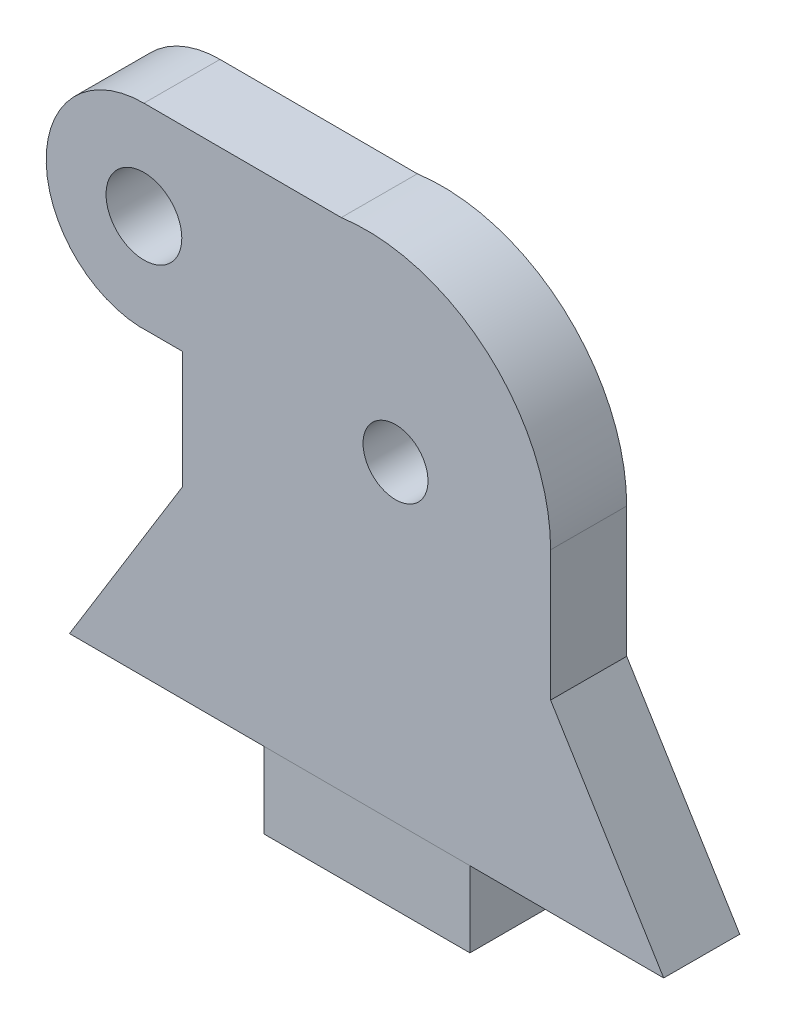
ISO-10303-21;
HEADER;
FILE_DESCRIPTION(('STEP AP214'),'2;1');
FILE_NAME('part.step','',(''),(''),'','','');
FILE_SCHEMA(('AUTOMOTIVE_DESIGN { 1 0 10303 214 1 1 1 1 }'));
ENDSEC;
DATA;
#1=APPLICATION_CONTEXT('core data for automotive mechanical design processes');
#2=APPLICATION_PROTOCOL_DEFINITION('international standard','automotive_design',2000,#1);
#3=PRODUCT_CONTEXT('',#1,'mechanical');
#4=PRODUCT('Part','Part','',(#3));
#5=PRODUCT_RELATED_PRODUCT_CATEGORY('part','',(#4));
#6=PRODUCT_DEFINITION_FORMATION('','',#4);
#7=PRODUCT_DEFINITION_CONTEXT('part definition',#1,'design');
#8=PRODUCT_DEFINITION('design','',#6,#7);
#9=PRODUCT_DEFINITION_SHAPE('','',#8);
#10=(LENGTH_UNIT() NAMED_UNIT(*) SI_UNIT(.MILLI.,.METRE.));
#11=(NAMED_UNIT(*) PLANE_ANGLE_UNIT() SI_UNIT($,.RADIAN.));
#12=(NAMED_UNIT(*) SI_UNIT($,.STERADIAN.) SOLID_ANGLE_UNIT());
#13=UNCERTAINTY_MEASURE_WITH_UNIT(LENGTH_MEASURE(1.E-05),#10,'distance_accuracy_value','');
#14=(GEOMETRIC_REPRESENTATION_CONTEXT(3) GLOBAL_UNCERTAINTY_ASSIGNED_CONTEXT((#13)) GLOBAL_UNIT_ASSIGNED_CONTEXT((#10,
#11,#12)) REPRESENTATION_CONTEXT('',''));
#15=CARTESIAN_POINT('',(0.,0.,0.));
#16=DIRECTION('',(0.,0.,1.));
#17=DIRECTION('',(1.,0.,0.));
#18=AXIS2_PLACEMENT_3D('',#15,#16,#17);
#19=CARTESIAN_POINT('',(71.415792523074,8.,61.2864109372668));
#20=DIRECTION('',(0.,1.,0.));
#21=DIRECTION('',(0.707106781186549,0.,0.707106781186546));
#22=AXIS2_PLACEMENT_3D('',#19,#20,#21);
#23=PLANE('',#22);
#24=DIRECTION('',(0.,0.,-1.));
#25=VECTOR('',#24,1.);
#26=CARTESIAN_POINT('',(10.8467152230062,8.,-24.5516889802997));
#27=LINE('',#26,#25);
#28=CARTESIAN_POINT('',(10.8467152227974,8.,-24.5516889802999));
#29=VERTEX_POINT('',#28);
#30=CARTESIAN_POINT('',(10.8467152230062,8.,-31.5144103550522));
#31=VERTEX_POINT('',#30);
#32=EDGE_CURVE('E155',#29,#31,#27,.T.);
#33=ORIENTED_EDGE('',*,*,#32,.F.);
#34=DIRECTION('',(0.999998073826402,0.,0.00196273877145065));
#35=VECTOR('',#34,1.);
#36=CARTESIAN_POINT('',(25.5255760238008,8.,-24.5228781555906));
#37=LINE('',#36,#35);
#38=CARTESIAN_POINT('',(-7.10845551512761,8.,-24.5869303579365));
#39=VERTEX_POINT('',#38);
#40=EDGE_CURVE('E165',#39,#29,#37,.T.);
#41=ORIENTED_EDGE('',*,*,#40,.F.);
#42=DIRECTION('',(-0.00196273877145081,0.,0.999998073826402));
#43=VECTOR('',#42,1.);
#44=CARTESIAN_POINT('',(-7.09471634372746,8.,-31.5869168747213));
#45=LINE('',#44,#43);
#46=CARTESIAN_POINT('',(-7.09471634372746,8.,-31.5869168747213));
#47=VERTEX_POINT('',#46);
#48=EDGE_CURVE('E169',#47,#39,#45,.T.);
#49=ORIENTED_EDGE('',*,*,#48,.F.);
#50=DIRECTION('',(0.999998073826402,0.,0.00196273877145065));
#51=VECTOR('',#50,1.);
#52=CARTESIAN_POINT('',(25.5393151952009,8.,-31.5228646723754));
#53=LINE('',#52,#51);
#54=CARTESIAN_POINT('',(29.8467152230062,8.,-31.5144103550522));
#55=VERTEX_POINT('',#54);
#56=EDGE_CURVE('E12',#47,#55,#53,.T.);
#57=ORIENTED_EDGE('',*,*,#56,.T.);
#58=DIRECTION('',(1.,0.,0.));
#59=VECTOR('',#58,1.);
#60=CARTESIAN_POINT('',(10.8467152230062,8.,-31.5144103550522));
#61=LINE('',#60,#59);
#62=EDGE_CURVE('E60',#31,#55,#61,.T.);
#63=ORIENTED_EDGE('',*,*,#62,.F.);
#64=EDGE_LOOP('',(#33,#41,#49,#57,#63));
#65=FACE_BOUND('',#64,.T.);
#66=ADVANCED_FACE('F36',(#65),#23,.F.);
#67=DIRECTION('',(-1.,0.,0.));
#68=VECTOR('',#67,1.);
#69=CARTESIAN_POINT('',(10.8467152230062,8.,-24.5516889802997));
#70=LINE('',#69,#68);
#71=CARTESIAN_POINT('',(29.8467152230062,8.,-24.5516889802997));
#72=VERTEX_POINT('',#71);
#73=EDGE_CURVE('E53',#72,#29,#70,.T.);
#74=ORIENTED_EDGE('',*,*,#73,.F.);
#75=DIRECTION('',(0.,0.,1.));
#76=VECTOR('',#75,1.);
#77=CARTESIAN_POINT('',(29.8467152230062,8.,-24.5516889802997));
#78=LINE('',#77,#76);
#79=EDGE_CURVE('E282',#55,#72,#78,.T.);
#80=ORIENTED_EDGE('',*,*,#79,.F.);
#81=CARTESIAN_POINT('',(47.7935848087063,8.,-31.4791852704406));
#82=VERTEX_POINT('',#81);
#83=EDGE_CURVE('E45',#55,#82,#53,.T.);
#84=ORIENTED_EDGE('',*,*,#83,.T.);
#85=DIRECTION('',(0.00196273877145081,0.,-0.999998073826402));
#86=VECTOR('',#85,1.);
#87=CARTESIAN_POINT('',(47.7935848087063,8.,-31.4791852704406));
#88=LINE('',#87,#86);
#89=CARTESIAN_POINT('',(47.7798456373062,8.,-24.4791987536558));
#90=VERTEX_POINT('',#89);
#91=EDGE_CURVE('E170',#90,#82,#88,.T.);
#92=ORIENTED_EDGE('',*,*,#91,.F.);
#93=EDGE_CURVE('E168',#29,#90,#37,.T.);
#94=ORIENTED_EDGE('',*,*,#93,.F.);
#95=EDGE_LOOP('',(#74,#80,#84,#92,#94));
#96=FACE_BOUND('',#95,.T.);
#97=ADVANCED_FACE('F254',(#96),#23,.F.);
#98=CARTESIAN_POINT('',(23.0082300446321,36.7773767864272,-24.5278190576621));
#99=DIRECTION('',(0.00196273877145081,0.,-0.999998073826403));
#100=DIRECTION('',(-0.999998073826403,0.,-0.00196273877145081));
#101=AXIS2_PLACEMENT_3D('',#98,#99,#100);
#102=CYLINDRICAL_SURFACE('',#101,3.);
#103=CARTESIAN_POINT('',(23.0082300446321,36.7773767864272,-24.5278190576621));
#104=DIRECTION('',(0.0019627387714507,0.,-0.999998073826402));
#105=DIRECTION('',(-0.999998073826402,0.,-0.0019627387714507));
#106=AXIS2_PLACEMENT_3D('',#103,#104,#105);
#107=CIRCLE('',#106,3.);
#108=CARTESIAN_POINT('',(20.0082358231529,36.7773767864272,-24.5337072739765));
#109=VERTEX_POINT('',#108);
#110=EDGE_CURVE('E175',#109,#109,#107,.T.);
#111=ORIENTED_EDGE('',*,*,#110,.F.);
#112=EDGE_LOOP('',(#111));
#113=FACE_BOUND('',#112,.T.);
#114=CARTESIAN_POINT('',(23.0219692160323,36.7773767864272,-31.5278055744469));
#115=DIRECTION('',(0.0019627387714507,0.,-0.999998073826402));
#116=DIRECTION('',(-0.999998073826402,0.,-0.0019627387714507));
#117=AXIS2_PLACEMENT_3D('',#114,#115,#116);
#118=CIRCLE('',#117,3.);
#119=CARTESIAN_POINT('',(20.0219749945531,36.7773767864272,-31.5336937907613));
#120=VERTEX_POINT('',#119);
#121=EDGE_CURVE('E179',#120,#120,#118,.T.);
#122=ORIENTED_EDGE('',*,*,#121,.T.);
#123=EDGE_LOOP('',(#122));
#124=FACE_BOUND('',#123,.T.);
#125=ADVANCED_FACE('F310',(#113,#124),#102,.F.);
#126=CARTESIAN_POINT('',(-0.21913046735704,44.7671616125226,-31.5734218697516));
#127=DIRECTION('',(-0.00196273877145048,0.,0.999998073826403));
#128=DIRECTION('',(0.999998073826402,0.,0.00196273877145042));
#129=AXIS2_PLACEMENT_3D('',#126,#127,#128);
#130=CYLINDRICAL_SURFACE('',#129,3.5);
#131=CARTESIAN_POINT('',(-0.21913046735704,44.7671616125226,-31.5734218697516));
#132=DIRECTION('',(-0.00196273877145042,0.,0.999998073826402));
#133=DIRECTION('',(0.999998073826402,0.,0.00196273877145042));
#134=AXIS2_PLACEMENT_3D('',#131,#132,#133);
#135=CIRCLE('',#134,3.5);
#136=CARTESIAN_POINT('',(3.28086279103537,44.7671616125226,-31.5665522840515));
#137=VERTEX_POINT('',#136);
#138=EDGE_CURVE('E159',#137,#137,#135,.T.);
#139=ORIENTED_EDGE('',*,*,#138,.F.);
#140=EDGE_LOOP('',(#139));
#141=FACE_BOUND('',#140,.T.);
#142=CARTESIAN_POINT('',(-0.232869638757193,44.7671616125226,-24.5734353529668));
#143=DIRECTION('',(-0.00196273877145042,0.,0.999998073826402));
#144=DIRECTION('',(0.999998073826402,0.,0.00196273877145042));
#145=AXIS2_PLACEMENT_3D('',#142,#143,#144);
#146=CIRCLE('',#145,3.5);
#147=CARTESIAN_POINT('',(3.26712361963521,44.7671616125226,-24.5665657672667));
#148=VERTEX_POINT('',#147);
#149=EDGE_CURVE('E156',#148,#148,#146,.T.);
#150=ORIENTED_EDGE('',*,*,#149,.T.);
#151=EDGE_LOOP('',(#150));
#152=FACE_BOUND('',#151,.T.);
#153=ADVANCED_FACE('F315',(#141,#152),#130,.F.);
#154=CARTESIAN_POINT('',(20.3494342324894,36.9567860572509,-31.5330510725809));
#155=DIRECTION('',(-0.00196273877145081,0.,0.999998073826403));
#156=DIRECTION('',(0.999998073826403,0.,0.00196273877145081));
#157=AXIS2_PLACEMENT_3D('',#154,#155,#156);
#158=CYLINDRICAL_SURFACE('',#157,17.);
#159=DIRECTION('',(-0.00196273877145081,0.,0.999998073826403));
#160=VECTOR('',#159,1.);
#161=CARTESIAN_POINT('',(18.0120803058191,53.7953357446553,-31.537638696592));
#162=LINE('',#161,#160);
#163=CARTESIAN_POINT('',(18.0120803058191,53.7953357446553,-31.537638696592));
#164=VERTEX_POINT('',#163);
#165=CARTESIAN_POINT('',(17.9983411344189,53.7953357446553,-24.5376521798072));
#166=VERTEX_POINT('',#165);
#167=EDGE_CURVE('E228',#164,#166,#162,.T.);
#168=ORIENTED_EDGE('',*,*,#167,.T.);
#169=CARTESIAN_POINT('',(20.3356950610893,36.9567860572509,-24.5330645557961));
#170=DIRECTION('',(0.0019627387714507,0.,-0.999998073826402));
#171=DIRECTION('',(-0.999998073826402,0.,-0.0019627387714507));
#172=AXIS2_PLACEMENT_3D('',#169,#170,#171);
#173=CIRCLE('',#172,17.);
#174=CARTESIAN_POINT('',(37.3356623161381,36.9567860572509,-24.4996979966815));
#175=VERTEX_POINT('',#174);
#176=EDGE_CURVE('E188',#166,#175,#173,.T.);
#177=ORIENTED_EDGE('',*,*,#176,.T.);
#178=DIRECTION('',(-0.00196273877145081,0.,0.999998073826403));
#179=VECTOR('',#178,1.);
#180=CARTESIAN_POINT('',(37.3494014875383,36.9567860572509,-31.4996845134663));
#181=LINE('',#180,#179);
#182=CARTESIAN_POINT('',(37.3494014875383,36.9567860572509,-31.4996845134663));
#183=VERTEX_POINT('',#182);
#184=EDGE_CURVE('E197',#183,#175,#181,.T.);
#185=ORIENTED_EDGE('',*,*,#184,.F.);
#186=CARTESIAN_POINT('',(20.3494342324894,36.9567860572509,-31.5330510725809));
#187=DIRECTION('',(0.0019627387714507,0.,-0.999998073826402));
#188=DIRECTION('',(-0.999998073826402,0.,-0.0019627387714507));
#189=AXIS2_PLACEMENT_3D('',#186,#187,#188);
#190=CIRCLE('',#189,17.);
#191=EDGE_CURVE('E211',#164,#183,#190,.T.);
#192=ORIENTED_EDGE('',*,*,#191,.F.);
#193=EDGE_LOOP('',(#168,#177,#185,#192));
#194=FACE_BOUND('',#193,.T.);
#195=ADVANCED_FACE('F264',(#194),#158,.T.);
#196=CARTESIAN_POINT('',(25.5393151952009,53.7953357446553,-31.5228646723754));
#197=DIRECTION('',(0.,1.,0.));
#198=DIRECTION('',(0.707106781186549,0.,0.707106781186546));
#199=AXIS2_PLACEMENT_3D('',#196,#197,#198);
#200=PLANE('',#199);
#201=DIRECTION('',(-0.999998073826402,0.,-0.00196273877145065));
#202=VECTOR('',#201,1.);
#203=CARTESIAN_POINT('',(25.5255760238008,53.7953357446553,-24.5228781555906));
#204=LINE('',#203,#202);
#205=CARTESIAN_POINT('',(-0.232869638757165,53.7953357446553,-24.5734353529668));
#206=VERTEX_POINT('',#205);
#207=EDGE_CURVE('E190',#166,#206,#204,.T.);
#208=ORIENTED_EDGE('',*,*,#207,.F.);
#209=ORIENTED_EDGE('',*,*,#167,.F.);
#210=DIRECTION('',(-0.999998073826402,0.,-0.00196273877145065));
#211=VECTOR('',#210,1.);
#212=CARTESIAN_POINT('',(25.5393151952009,53.7953357446553,-31.5228646723754));
#213=LINE('',#212,#211);
#214=CARTESIAN_POINT('',(-0.219130467357012,53.7953357446553,-31.5734218697516));
#215=VERTEX_POINT('',#214);
#216=EDGE_CURVE('E216',#164,#215,#213,.T.);
#217=ORIENTED_EDGE('',*,*,#216,.T.);
#218=DIRECTION('',(-0.00196273877145081,0.,0.999998073826403));
#219=VECTOR('',#218,1.);
#220=CARTESIAN_POINT('',(-0.219130467357012,53.7953357446553,-31.5734218697516));
#221=LINE('',#220,#219);
#222=EDGE_CURVE('E171',#215,#206,#221,.T.);
#223=ORIENTED_EDGE('',*,*,#222,.T.);
#224=EDGE_LOOP('',(#208,#209,#217,#223));
#225=FACE_BOUND('',#224,.T.);
#226=ADVANCED_FACE('F267',(#225),#200,.T.);
#227=CARTESIAN_POINT('',(-0.219130467357012,44.7671616125226,-31.5734218697516));
#228=DIRECTION('',(-0.00196273877145081,0.,0.999998073826403));
#229=DIRECTION('',(0.999998073826403,0.,0.00196273877145081));
#230=AXIS2_PLACEMENT_3D('',#227,#228,#229);
#231=CYLINDRICAL_SURFACE('',#230,9.02817413213266);
#232=CARTESIAN_POINT('',(-0.232869638757165,44.7671616125226,-24.5734353529668));
#233=DIRECTION('',(0.00196273877145065,0.,-0.999998073826402));
#234=DIRECTION('',(-0.999998073826402,0.,-0.00196273877145065));
#235=AXIS2_PLACEMENT_3D('',#232,#233,#234);
#236=CIRCLE('',#235,9.02817413213266);
#237=CARTESIAN_POINT('',(0.373410198765602,35.7593676815597,-24.5722453817312));
#238=VERTEX_POINT('',#237);
#239=EDGE_CURVE('E194',#206,#238,#236,.F.);
#240=ORIENTED_EDGE('',*,*,#239,.F.);
#241=ORIENTED_EDGE('',*,*,#222,.F.);
#242=CARTESIAN_POINT('',(-0.219130467357012,44.7671616125226,-31.5734218697516));
#243=DIRECTION('',(0.00196273877145065,0.,-0.999998073826402));
#244=DIRECTION('',(-0.999998073826402,0.,-0.00196273877145065));
#245=AXIS2_PLACEMENT_3D('',#242,#243,#244);
#246=CIRCLE('',#245,9.02817413213266);
#247=CARTESIAN_POINT('',(0.387149370165756,35.7593676815597,-31.572231898516));
#248=VERTEX_POINT('',#247);
#249=EDGE_CURVE('E200',#215,#248,#246,.F.);
#250=ORIENTED_EDGE('',*,*,#249,.T.);
#251=DIRECTION('',(-0.00196273877145081,0.,0.999998073826403));
#252=VECTOR('',#251,1.);
#253=CARTESIAN_POINT('',(0.387149370165756,35.7593676815597,-31.572231898516));
#254=LINE('',#253,#252);
#255=EDGE_CURVE('E215',#248,#238,#254,.T.);
#256=ORIENTED_EDGE('',*,*,#255,.T.);
#257=EDGE_LOOP('',(#240,#241,#250,#256));
#258=FACE_BOUND('',#257,.T.);
#259=ADVANCED_FACE('F271',(#258),#231,.T.);
#260=CARTESIAN_POINT('',(25.5393151952009,35.7593676815597,-31.5228646723754));
#261=DIRECTION('',(0.,-1.,0.));
#262=DIRECTION('',(-0.707106781186549,0.,-0.707106781186546));
#263=AXIS2_PLACEMENT_3D('',#260,#261,#262);
#264=PLANE('',#263);
#265=DIRECTION('',(0.999998073826402,0.,0.00196273877145065));
#266=VECTOR('',#265,1.);
#267=CARTESIAN_POINT('',(25.5255760238008,35.7593676815597,-24.5228781555906));
#268=LINE('',#267,#266);
#269=CARTESIAN_POINT('',(3.33572780604044,35.7593676815597,-24.5664311149108));
#270=VERTEX_POINT('',#269);
#271=EDGE_CURVE('E193',#238,#270,#268,.T.);
#272=ORIENTED_EDGE('',*,*,#271,.F.);
#273=ORIENTED_EDGE('',*,*,#255,.F.);
#274=DIRECTION('',(0.999998073826402,0.,0.00196273877145065));
#275=VECTOR('',#274,1.);
#276=CARTESIAN_POINT('',(25.5393151952009,35.7593676815597,-31.5228646723754));
#277=LINE('',#276,#275);
#278=CARTESIAN_POINT('',(3.3494669774406,35.7593676815597,-31.5664176316956));
#279=VERTEX_POINT('',#278);
#280=EDGE_CURVE('E212',#248,#279,#277,.T.);
#281=ORIENTED_EDGE('',*,*,#280,.T.);
#282=DIRECTION('',(-0.00196273877145081,0.,0.999998073826403));
#283=VECTOR('',#282,1.);
#284=CARTESIAN_POINT('',(3.3494669774406,35.7593676815597,-31.5664176316956));
#285=LINE('',#284,#283);
#286=EDGE_CURVE('E230',#279,#270,#285,.T.);
#287=ORIENTED_EDGE('',*,*,#286,.T.);
#288=EDGE_LOOP('',(#272,#273,#281,#287));
#289=FACE_BOUND('',#288,.T.);
#290=ADVANCED_FACE('F274',(#289),#264,.T.);
#291=CARTESIAN_POINT('',(37.3494014875383,36.9567860572509,-31.4996845134663));
#292=DIRECTION('',(-0.999998073826403,0.,-0.00196273877145081));
#293=DIRECTION('',(-0.00196273877145081,0.,0.999998073826403));
#294=AXIS2_PLACEMENT_3D('',#291,#292,#293);
#295=PLANE('',#294);
#296=DIRECTION('',(0.,-1.,0.));
#297=VECTOR('',#296,1.);
#298=CARTESIAN_POINT('',(37.3356623161381,36.9567860572509,-24.4996979966815));
#299=LINE('',#298,#297);
#300=CARTESIAN_POINT('',(37.3356623161381,24.9567860572509,-24.4996979966815));
#301=VERTEX_POINT('',#300);
#302=EDGE_CURVE('E186',#175,#301,#299,.T.);
#303=ORIENTED_EDGE('',*,*,#302,.T.);
#304=DIRECTION('',(-0.00196273877145081,0.,0.999998073826403));
#305=VECTOR('',#304,1.);
#306=CARTESIAN_POINT('',(37.3494014875383,24.9567860572509,-31.4996845134663));
#307=LINE('',#306,#305);
#308=CARTESIAN_POINT('',(37.3494014875383,24.9567860572509,-31.4996845134663));
#309=VERTEX_POINT('',#308);
#310=EDGE_CURVE('E40',#309,#301,#307,.T.);
#311=ORIENTED_EDGE('',*,*,#310,.F.);
#312=DIRECTION('',(0.,-1.,0.));
#313=VECTOR('',#312,1.);
#314=CARTESIAN_POINT('',(37.3494014875383,36.9567860572509,-31.4996845134663));
#315=LINE('',#314,#313);
#316=EDGE_CURVE('E222',#183,#309,#315,.T.);
#317=ORIENTED_EDGE('',*,*,#316,.F.);
#318=ORIENTED_EDGE('',*,*,#184,.T.);
#319=EDGE_LOOP('',(#303,#311,#317,#318));
#320=FACE_BOUND('',#319,.T.);
#321=ADVANCED_FACE('F262',(#320),#295,.F.);
#322=CARTESIAN_POINT('',(3.3494669774406,24.9567860572509,-31.5664176316956));
#323=DIRECTION('',(0.999998073826403,0.,0.00196273877145081));
#324=DIRECTION('',(0.00196273877145081,0.,-0.999998073826403));
#325=AXIS2_PLACEMENT_3D('',#322,#323,#324);
#326=PLANE('',#325);
#327=ORIENTED_EDGE('',*,*,#286,.F.);
#328=DIRECTION('',(0.,1.,0.));
#329=VECTOR('',#328,1.);
#330=CARTESIAN_POINT('',(3.3494669774406,24.9567860572509,-31.5664176316956));
#331=LINE('',#330,#329);
#332=CARTESIAN_POINT('',(3.3494669774406,24.9567860572509,-31.5664176316956));
#333=VERTEX_POINT('',#332);
#334=EDGE_CURVE('E182',#333,#279,#331,.T.);
#335=ORIENTED_EDGE('',*,*,#334,.F.);
#336=DIRECTION('',(-0.00196273877145081,0.,0.999998073826403));
#337=VECTOR('',#336,1.);
#338=CARTESIAN_POINT('',(3.3494669774406,24.9567860572509,-31.5664176316956));
#339=LINE('',#338,#337);
#340=CARTESIAN_POINT('',(3.33572780604044,24.9567860572509,-24.5664311149108));
#341=VERTEX_POINT('',#340);
#342=EDGE_CURVE('E207',#333,#341,#339,.T.);
#343=ORIENTED_EDGE('',*,*,#342,.T.);
#344=DIRECTION('',(0.,1.,0.));
#345=VECTOR('',#344,1.);
#346=CARTESIAN_POINT('',(3.33572780604044,24.9567860572509,-24.5664311149108));
#347=LINE('',#346,#345);
#348=EDGE_CURVE('E178',#341,#270,#347,.T.);
#349=ORIENTED_EDGE('',*,*,#348,.T.);
#350=EDGE_LOOP('',(#327,#335,#343,#349));
#351=FACE_BOUND('',#350,.T.);
#352=ADVANCED_FACE('F276',(#351),#326,.F.);
#353=CARTESIAN_POINT('',(25.5255760238008,0.,-24.5228781555906));
#354=DIRECTION('',(0.00196273877145065,0.,-0.999998073826402));
#355=DIRECTION('',(-0.999998073826402,0.,-0.00196273877145065));
#356=AXIS2_PLACEMENT_3D('',#353,#354,#355);
#357=PLANE('',#356);
#358=ORIENTED_EDGE('',*,*,#149,.F.);
#359=EDGE_LOOP('',(#358));
#360=FACE_BOUND('',#359,.T.);
#361=ORIENTED_EDGE('',*,*,#110,.T.);
#362=EDGE_LOOP('',(#361));
#363=FACE_BOUND('',#362,.T.);
#364=DIRECTION('',(0.524433562384263,0.851450749678852,0.00102932806860601));
#365=VECTOR('',#364,1.);
#366=CARTESIAN_POINT('',(-7.16425196913679,7.90941096069529,-24.587039872011));
#367=LINE('',#366,#365);
#368=EDGE_CURVE('E180',#39,#341,#367,.T.);
#369=ORIENTED_EDGE('',*,*,#368,.F.);
#370=ORIENTED_EDGE('',*,*,#40,.T.);
#371=ORIENTED_EDGE('',*,*,#93,.T.);
#372=DIRECTION('',(0.524433562384263,-0.851450749678852,0.00102932806860645));
#373=VECTOR('',#372,1.);
#374=CARTESIAN_POINT('',(37.3356623161381,24.9567860572509,-24.4996979966815));
#375=LINE('',#374,#373);
#376=EDGE_CURVE('E183',#301,#90,#375,.T.);
#377=ORIENTED_EDGE('',*,*,#376,.F.);
#378=ORIENTED_EDGE('',*,*,#302,.F.);
#379=ORIENTED_EDGE('',*,*,#176,.F.);
#380=ORIENTED_EDGE('',*,*,#207,.T.);
#381=ORIENTED_EDGE('',*,*,#239,.T.);
#382=ORIENTED_EDGE('',*,*,#271,.T.);
#383=ORIENTED_EDGE('',*,*,#348,.F.);
#384=EDGE_LOOP('',(#369,#370,#371,#377,#378,#379,#380,#381,#382,#383));
#385=FACE_BOUND('',#384,.T.);
#386=ADVANCED_FACE('F250',(#360,#363,#385),#357,.F.);
#387=CARTESIAN_POINT('',(25.5393151952009,0.,-31.5228646723754));
#388=DIRECTION('',(0.00196273877145065,0.,-0.999998073826402));
#389=DIRECTION('',(-0.999998073826402,0.,-0.00196273877145065));
#390=AXIS2_PLACEMENT_3D('',#387,#388,#389);
#391=PLANE('',#390);
#392=ORIENTED_EDGE('',*,*,#56,.F.);
#393=DIRECTION('',(0.524433562384263,0.851450749678852,0.00102932806860601));
#394=VECTOR('',#393,1.);
#395=CARTESIAN_POINT('',(-7.15051279773664,7.90941096069529,-31.5870263887958));
#396=LINE('',#395,#394);
#397=EDGE_CURVE('E205',#47,#333,#396,.T.);
#398=ORIENTED_EDGE('',*,*,#397,.T.);
#399=ORIENTED_EDGE('',*,*,#334,.T.);
#400=ORIENTED_EDGE('',*,*,#280,.F.);
#401=ORIENTED_EDGE('',*,*,#249,.F.);
#402=ORIENTED_EDGE('',*,*,#216,.F.);
#403=ORIENTED_EDGE('',*,*,#191,.T.);
#404=ORIENTED_EDGE('',*,*,#316,.T.);
#405=DIRECTION('',(0.524433562384263,-0.851450749678852,0.00102932806860645));
#406=VECTOR('',#405,1.);
#407=CARTESIAN_POINT('',(37.3494014875383,24.9567860572509,-31.4996845134663));
#408=LINE('',#407,#406);
#409=EDGE_CURVE('E208',#309,#82,#408,.T.);
#410=ORIENTED_EDGE('',*,*,#409,.T.);
#411=ORIENTED_EDGE('',*,*,#83,.F.);
#412=EDGE_LOOP('',(#392,#398,#399,#400,#401,#402,#403,#404,#410,#411));
#413=FACE_BOUND('',#412,.T.);
#414=ORIENTED_EDGE('',*,*,#138,.T.);
#415=EDGE_LOOP('',(#414));
#416=FACE_BOUND('',#415,.T.);
#417=ORIENTED_EDGE('',*,*,#121,.F.);
#418=EDGE_LOOP('',(#417));
#419=FACE_BOUND('',#418,.T.);
#420=ADVANCED_FACE('F257',(#413,#416,#419),#391,.T.);
#421=CARTESIAN_POINT('',(-7.15051279773664,7.90941096069529,-31.5870263887958));
#422=DIRECTION('',(0.851449109636898,-0.52443457253629,0.00167117539837552));
#423=DIRECTION('',(0.00196273877145081,0.,-0.999998073826402));
#424=AXIS2_PLACEMENT_3D('',#421,#422,#423);
#425=PLANE('',#424);
#426=ORIENTED_EDGE('',*,*,#397,.F.);
#427=ORIENTED_EDGE('',*,*,#48,.T.);
#428=ORIENTED_EDGE('',*,*,#368,.T.);
#429=ORIENTED_EDGE('',*,*,#342,.F.);
#430=EDGE_LOOP('',(#426,#427,#428,#429));
#431=FACE_BOUND('',#430,.T.);
#432=ADVANCED_FACE('F279',(#431),#425,.F.);
#433=CARTESIAN_POINT('',(37.3494014875383,24.9567860572509,-31.4996845134663));
#434=DIRECTION('',(-0.851449109636898,-0.52443457253629,-0.00167117539837552));
#435=DIRECTION('',(-0.00196273877145081,0.,0.999998073826402));
#436=AXIS2_PLACEMENT_3D('',#433,#434,#435);
#437=PLANE('',#436);
#438=ORIENTED_EDGE('',*,*,#376,.T.);
#439=ORIENTED_EDGE('',*,*,#91,.T.);
#440=ORIENTED_EDGE('',*,*,#409,.F.);
#441=ORIENTED_EDGE('',*,*,#310,.T.);
#442=EDGE_LOOP('',(#438,#439,#440,#441));
#443=FACE_BOUND('',#442,.T.);
#444=ADVANCED_FACE('F38',(#443),#437,.F.);
#445=CARTESIAN_POINT('',(10.8467152230062,1.,-24.5516889802997));
#446=DIRECTION('',(1.,0.,0.));
#447=DIRECTION('',(0.,0.,-1.));
#448=AXIS2_PLACEMENT_3D('',#445,#446,#447);
#449=PLANE('',#448);
#450=ORIENTED_EDGE('',*,*,#32,.T.);
#451=DIRECTION('',(0.,1.,0.));
#452=VECTOR('',#451,1.);
#453=CARTESIAN_POINT('',(10.8467152230062,1.,-31.5144103550522));
#454=LINE('',#453,#452);
#455=CARTESIAN_POINT('',(10.8467152230062,1.,-31.5144103550522));
#456=VERTEX_POINT('',#455);
#457=EDGE_CURVE('E137',#456,#31,#454,.T.);
#458=ORIENTED_EDGE('',*,*,#457,.F.);
#459=DIRECTION('',(0.,0.,-1.));
#460=VECTOR('',#459,1.);
#461=CARTESIAN_POINT('',(10.8467152230062,1.,-24.5516889802997));
#462=LINE('',#461,#460);
#463=CARTESIAN_POINT('',(10.8467152230062,1.,-24.5516889802997));
#464=VERTEX_POINT('',#463);
#465=EDGE_CURVE('E144',#464,#456,#462,.T.);
#466=ORIENTED_EDGE('',*,*,#465,.F.);
#467=DIRECTION('',(0.,1.,0.));
#468=VECTOR('',#467,1.);
#469=CARTESIAN_POINT('',(10.8467152230062,1.,-24.5516889802997));
#470=LINE('',#469,#468);
#471=EDGE_CURVE('E289',#464,#29,#470,.T.);
#472=ORIENTED_EDGE('',*,*,#471,.T.);
#473=EDGE_LOOP('',(#450,#458,#466,#472));
#474=FACE_BOUND('',#473,.T.);
#475=ADVANCED_FACE('F154',(#474),#449,.F.);
#476=CARTESIAN_POINT('',(10.8467152230062,1.,-31.5144103550522));
#477=DIRECTION('',(0.,0.,1.));
#478=DIRECTION('',(1.,0.,0.));
#479=AXIS2_PLACEMENT_3D('',#476,#477,#478);
#480=PLANE('',#479);
#481=ORIENTED_EDGE('',*,*,#62,.T.);
#482=DIRECTION('',(0.,1.,0.));
#483=VECTOR('',#482,1.);
#484=CARTESIAN_POINT('',(29.8467152230062,1.,-31.5144103550522));
#485=LINE('',#484,#483);
#486=CARTESIAN_POINT('',(29.8467152230062,1.,-31.5144103550522));
#487=VERTEX_POINT('',#486);
#488=EDGE_CURVE('E140',#487,#55,#485,.T.);
#489=ORIENTED_EDGE('',*,*,#488,.F.);
#490=DIRECTION('',(1.,0.,0.));
#491=VECTOR('',#490,1.);
#492=CARTESIAN_POINT('',(10.8467152230062,1.,-31.5144103550522));
#493=LINE('',#492,#491);
#494=EDGE_CURVE('E133',#456,#487,#493,.T.);
#495=ORIENTED_EDGE('',*,*,#494,.F.);
#496=ORIENTED_EDGE('',*,*,#457,.T.);
#497=EDGE_LOOP('',(#481,#489,#495,#496));
#498=FACE_BOUND('',#497,.T.);
#499=ADVANCED_FACE('F135',(#498),#480,.F.);
#500=CARTESIAN_POINT('',(29.8467152230062,1.,-24.5516889802997));
#501=DIRECTION('',(-1.,0.,0.));
#502=DIRECTION('',(0.,0.,1.));
#503=AXIS2_PLACEMENT_3D('',#500,#501,#502);
#504=PLANE('',#503);
#505=ORIENTED_EDGE('',*,*,#79,.T.);
#506=DIRECTION('',(0.,1.,0.));
#507=VECTOR('',#506,1.);
#508=CARTESIAN_POINT('',(29.8467152230062,1.,-24.5516889802997));
#509=LINE('',#508,#507);
#510=CARTESIAN_POINT('',(29.8467152230062,1.,-24.5516889802997));
#511=VERTEX_POINT('',#510);
#512=EDGE_CURVE('E161',#511,#72,#509,.T.);
#513=ORIENTED_EDGE('',*,*,#512,.F.);
#514=DIRECTION('',(0.,0.,1.));
#515=VECTOR('',#514,1.);
#516=CARTESIAN_POINT('',(29.8467152230062,1.,-24.5516889802997));
#517=LINE('',#516,#515);
#518=EDGE_CURVE('E143',#487,#511,#517,.T.);
#519=ORIENTED_EDGE('',*,*,#518,.F.);
#520=ORIENTED_EDGE('',*,*,#488,.T.);
#521=EDGE_LOOP('',(#505,#513,#519,#520));
#522=FACE_BOUND('',#521,.T.);
#523=ADVANCED_FACE('F295',(#522),#504,.F.);
#524=CARTESIAN_POINT('',(10.8467152230062,1.,-24.5516889802997));
#525=DIRECTION('',(0.,0.,-1.));
#526=DIRECTION('',(-1.,0.,0.));
#527=AXIS2_PLACEMENT_3D('',#524,#525,#526);
#528=PLANE('',#527);
#529=ORIENTED_EDGE('',*,*,#73,.T.);
#530=ORIENTED_EDGE('',*,*,#471,.F.);
#531=DIRECTION('',(-1.,0.,0.));
#532=VECTOR('',#531,1.);
#533=CARTESIAN_POINT('',(10.8467152230062,1.,-24.5516889802997));
#534=LINE('',#533,#532);
#535=EDGE_CURVE('E149',#511,#464,#534,.T.);
#536=ORIENTED_EDGE('',*,*,#535,.F.);
#537=ORIENTED_EDGE('',*,*,#512,.T.);
#538=EDGE_LOOP('',(#529,#530,#536,#537));
#539=FACE_BOUND('',#538,.T.);
#540=ADVANCED_FACE('F293',(#539),#528,.F.);
#541=CARTESIAN_POINT('',(0.,1.,0.));
#542=DIRECTION('',(0.,-1.,0.));
#543=DIRECTION('',(0.,0.,-1.));
#544=AXIS2_PLACEMENT_3D('',#541,#542,#543);
#545=PLANE('',#544);
#546=ORIENTED_EDGE('',*,*,#465,.T.);
#547=ORIENTED_EDGE('',*,*,#494,.T.);
#548=ORIENTED_EDGE('',*,*,#518,.T.);
#549=ORIENTED_EDGE('',*,*,#535,.T.);
#550=EDGE_LOOP('',(#546,#547,#548,#549));
#551=FACE_BOUND('',#550,.T.);
#552=ADVANCED_FACE('F147',(#551),#545,.T.);
#553=CLOSED_SHELL('',(#66,#97,#125,#153,#195,#226,#259,#290,#321,#352,#386,#420,#432,#444,#475,
#499,#523,#540,#552));
#554=MANIFOLD_SOLID_BREP('B2',#553);
#555=ADVANCED_BREP_SHAPE_REPRESENTATION('',(#18,#554),#14);
#556=SHAPE_DEFINITION_REPRESENTATION(#9,#555);
ENDSEC;
END-ISO-10303-21;
